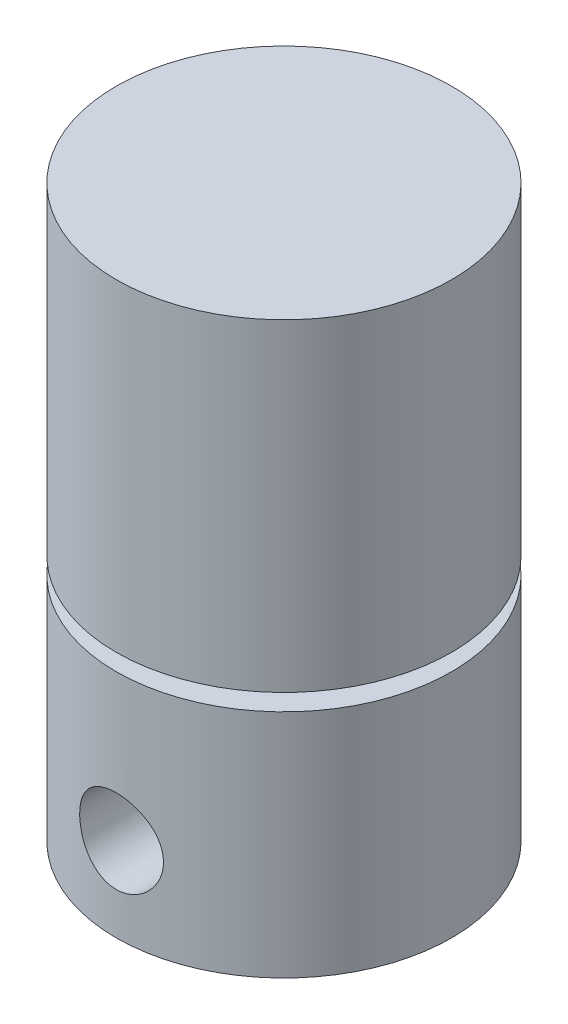
ISO-10303-21;
HEADER;
FILE_DESCRIPTION(('STEP AP214'),'2;1');
FILE_NAME('part.step','',(''),(''),'','','');
FILE_SCHEMA(('AUTOMOTIVE_DESIGN { 1 0 10303 214 1 1 1 1 }'));
ENDSEC;
DATA;
#1=APPLICATION_CONTEXT('core data for automotive mechanical design processes');
#2=APPLICATION_PROTOCOL_DEFINITION('international standard','automotive_design',2000,#1);
#3=PRODUCT_CONTEXT('',#1,'mechanical');
#4=PRODUCT('Part','Part','',(#3));
#5=PRODUCT_RELATED_PRODUCT_CATEGORY('part','',(#4));
#6=PRODUCT_DEFINITION_FORMATION('','',#4);
#7=PRODUCT_DEFINITION_CONTEXT('part definition',#1,'design');
#8=PRODUCT_DEFINITION('design','',#6,#7);
#9=PRODUCT_DEFINITION_SHAPE('','',#8);
#10=(LENGTH_UNIT() NAMED_UNIT(*) SI_UNIT(.MILLI.,.METRE.));
#11=(NAMED_UNIT(*) PLANE_ANGLE_UNIT() SI_UNIT($,.RADIAN.));
#12=(NAMED_UNIT(*) SI_UNIT($,.STERADIAN.) SOLID_ANGLE_UNIT());
#13=UNCERTAINTY_MEASURE_WITH_UNIT(LENGTH_MEASURE(1.E-05),#10,'distance_accuracy_value','');
#14=(GEOMETRIC_REPRESENTATION_CONTEXT(3) GLOBAL_UNCERTAINTY_ASSIGNED_CONTEXT((#13)) GLOBAL_UNIT_ASSIGNED_CONTEXT((#10,
#11,#12)) REPRESENTATION_CONTEXT('',''));
#15=CARTESIAN_POINT('',(0.,0.,0.));
#16=DIRECTION('',(0.,0.,1.));
#17=DIRECTION('',(1.,0.,0.));
#18=AXIS2_PLACEMENT_3D('',#15,#16,#17);
#19=CARTESIAN_POINT('',(0.,17.4625,0.));
#20=DIRECTION('',(0.,-1.,0.));
#21=DIRECTION('',(0.,0.,-1.));
#22=AXIS2_PLACEMENT_3D('',#19,#20,#21);
#23=CYLINDRICAL_SURFACE('',#22,12.7);
#24=CARTESIAN_POINT('',(3.175,6.35,-12.2967221242085));
#25=CARTESIAN_POINT('',(3.1749950198132,6.17467554632325,-12.2967254711158));
#26=CARTESIAN_POINT('',(3.16042833178202,5.99929597867828,-12.3005126863854));
#27=CARTESIAN_POINT('',(3.10263936933902,5.65357317571964,-12.3152136473056));
#28=CARTESIAN_POINT('',(3.05940041756247,5.4832329318254,-12.3261315404947));
#29=CARTESIAN_POINT('',(2.94575382353269,5.15263950650228,-12.3537818023711));
#30=CARTESIAN_POINT('',(2.8753812543752,4.99237361266015,-12.3705066621688));
#31=CARTESIAN_POINT('',(2.70957184940196,4.68590521727435,-12.4078770387652));
#32=CARTESIAN_POINT('',(2.61413394947207,4.53970331315812,-12.4285227220068));
#33=CARTESIAN_POINT('',(2.39865970268609,4.26229571051699,-12.4719170977164));
#34=CARTESIAN_POINT('',(2.27817284738414,4.13144512755544,-12.4946993898125));
#35=CARTESIAN_POINT('',(2.01699122140784,3.89158302916237,-12.5395085190442));
#36=CARTESIAN_POINT('',(1.87629456360899,3.78257355546038,-12.5615352853931));
#37=CARTESIAN_POINT('',(1.57625440537027,3.58803515610828,-12.6027232771114));
#38=CARTESIAN_POINT('',(1.4166781117678,3.50285508703494,-12.6218402299875));
#39=CARTESIAN_POINT('',(1.08491424405181,3.36066175192558,-12.65467131146));
#40=CARTESIAN_POINT('',(0.912728534955764,3.3036443300673,-12.6683862371462));
#41=CARTESIAN_POINT('',(0.564335623617785,3.2205322500852,-12.6886304373719));
#42=CARTESIAN_POINT('',(0.388280553827199,3.19383455170524,-12.6952996518228));
#43=CARTESIAN_POINT('',(0.0340726004637171,3.17022685832005,-12.7011886451627));
#44=CARTESIAN_POINT('',(-0.144079969063347,3.17331245929381,-12.7004095254281));
#45=CARTESIAN_POINT('',(-0.493243384772329,3.20875005981768,-12.6915938059099));
#46=CARTESIAN_POINT('',(-0.664324984533387,3.2404511328184,-12.6837186297291));
#47=CARTESIAN_POINT('',(-0.998658935538454,3.33117351296159,-12.6617836238657));
#48=CARTESIAN_POINT('',(-1.16191086950114,3.39019627442931,-12.6477234649603));
#49=CARTESIAN_POINT('',(-1.47766628361824,3.53441326477257,-12.6147513732012));
#50=CARTESIAN_POINT('',(-1.63005931850865,3.61983914672042,-12.5957967501266));
#51=CARTESIAN_POINT('',(-1.91857510093105,3.81426171247765,-12.5550917783831));
#52=CARTESIAN_POINT('',(-2.05469501139648,3.923262497072,-12.5333409435887));
#53=CARTESIAN_POINT('',(-2.31068256139473,4.16523010231761,-12.4887191648708));
#54=CARTESIAN_POINT('',(-2.43001063106375,4.29876571328164,-12.4658338379713));
#55=CARTESIAN_POINT('',(-2.64469999368259,4.58419196639616,-12.4220610526701));
#56=CARTESIAN_POINT('',(-2.74006016644614,4.7360834659537,-12.4011736876753));
#57=CARTESIAN_POINT('',(-2.90445230964671,5.05496834336905,-12.3637103097324));
#58=CARTESIAN_POINT('',(-2.97335437513118,5.22203137749726,-12.347155693206));
#59=CARTESIAN_POINT('',(-3.08192684552051,5.56588354445759,-12.3205067298881));
#60=CARTESIAN_POINT('',(-3.12160350580598,5.74267058726044,-12.3104110007027));
#61=CARTESIAN_POINT('',(-3.16970364110572,6.095948566943,-12.2981130212947));
#62=CARTESIAN_POINT('',(-3.17892490187728,6.2723239975431,-12.2957093300071));
#63=CARTESIAN_POINT('',(-3.16803657795425,6.62409385946327,-12.2985192607316));
#64=CARTESIAN_POINT('',(-3.14792969326925,6.79948837959579,-12.3037321815428));
#65=CARTESIAN_POINT('',(-3.07965533920158,7.14135511648469,-12.3209949412092));
#66=CARTESIAN_POINT('',(-3.03195236671802,7.30792636274288,-12.3329315220802));
#67=CARTESIAN_POINT('',(-2.91035496372149,7.63070795147373,-12.3621891219376));
#68=CARTESIAN_POINT('',(-2.83645743059488,7.78691706400085,-12.3795107787294));
#69=CARTESIAN_POINT('',(-2.66289874827948,8.08792042289096,-12.418010941113));
#70=CARTESIAN_POINT('',(-2.56276062737126,8.23243062685459,-12.439258441312));
#71=CARTESIAN_POINT('',(-2.34016643006688,8.50288922075787,-12.4830469550031));
#72=CARTESIAN_POINT('',(-2.21770668600727,8.62883455414564,-12.5055881806495));
#73=CARTESIAN_POINT('',(-1.95028413912651,8.86182002406507,-12.5501070185035));
#74=CARTESIAN_POINT('',(-1.80483494928781,8.96830827943698,-12.5720564161859));
#75=CARTESIAN_POINT('',(-1.49765601755559,9.15534855102809,-12.6123346509939));
#76=CARTESIAN_POINT('',(-1.33592712544035,9.23590192009242,-12.6306636769502));
#77=CARTESIAN_POINT('',(-1.00189729049621,9.36808646385047,-12.6615204698767));
#78=CARTESIAN_POINT('',(-0.829682684763527,9.41992564116141,-12.6740898412846));
#79=CARTESIAN_POINT('',(-0.478630489012213,9.49383462495269,-12.6921932261265));
#80=CARTESIAN_POINT('',(-0.299794184005939,9.51591017659858,-12.6977285972965));
#81=CARTESIAN_POINT('',(0.0542401964575508,9.52934209690234,-12.7010848787296));
#82=CARTESIAN_POINT('',(0.229405900617119,9.52151292637792,-12.6991103294396));
#83=CARTESIAN_POINT('',(0.575841801116834,9.47722314834044,-12.6881222125238));
#84=CARTESIAN_POINT('',(0.747112113154448,9.44076339233319,-12.6791088542401));
#85=CARTESIAN_POINT('',(1.08004303817216,9.34068420222751,-12.655087493111));
#86=CARTESIAN_POINT('',(1.24175042029424,9.27721203572685,-12.640112022951));
#87=CARTESIAN_POINT('',(1.55231164340716,9.12504341161286,-12.6057434230086));
#88=CARTESIAN_POINT('',(1.70116386101839,9.03634377427121,-12.5863497364056));
#89=CARTESIAN_POINT('',(1.98565112274399,8.83375413206227,-12.5446551773491));
#90=CARTESIAN_POINT('',(2.12088408784722,8.71931154628034,-12.5222957878978));
#91=CARTESIAN_POINT('',(2.37050268936837,8.46955744497192,-12.4774531075658));
#92=CARTESIAN_POINT('',(2.48488303211817,8.33424064634706,-12.4549697867118));
#93=CARTESIAN_POINT('',(2.69164443404806,8.04354050994846,-12.4119473580947));
#94=CARTESIAN_POINT('',(2.783575266647,7.88782990831532,-12.3914523466269));
#95=CARTESIAN_POINT('',(2.93981789665887,7.56267381964745,-12.3553205869608));
#96=CARTESIAN_POINT('',(3.00414978846308,7.39323843265204,-12.3396803064045));
#97=CARTESIAN_POINT('',(3.09379152821293,7.07841798742337,-12.3174731028359));
#98=CARTESIAN_POINT('',(3.12417831664509,6.93453920307402,-12.3097500503611));
#99=CARTESIAN_POINT('',(3.16478377891537,6.64378634093234,-12.2993733749982));
#100=CARTESIAN_POINT('',(3.17500417313031,6.49691251972402,-12.2967193196792));
#101=CARTESIAN_POINT('',(3.175,6.35,-12.2967221242085));
#102=B_SPLINE_CURVE_WITH_KNOTS('',3,(#24,#25,#26,#27,#28,#29,#30,#31,#32,#33,#34,#35,#36,#37,
#38,#39,#40,#41,#42,#43,#44,#45,#46,#47,#48,#49,#50,#51,#52,#53,#54,#55,#56,#57,#58,#59,#60,#61,
#62,#63,#64,#65,#66,#67,#68,#69,#70,#71,#72,#73,#74,#75,#76,#77,#78,#79,#80,#81,#82,#83,#84,#85,
#86,#87,#88,#89,#90,#91,#92,#93,#94,#95,#96,#97,#98,#99,#100,#101),.UNSPECIFIED.,.T.,.F.,(4,2,2,
2,2,2,2,2,2,2,2,2,2,2,2,2,2,2,2,2,2,2,2,2,2,2,2,2,2,2,2,2,2,2,2,2,2,2,4),(0.,0.525433851004893,
1.05117359161441,1.57623602350085,2.10132074979458,2.6368242182508,3.1723777227943,
3.71540400425358,4.25835013005807,4.7902971376409,5.32216548805846,5.84223193614963,
6.36232607040478,6.88711950303144,7.4120042954552,7.95109492546328,8.49021074623749,
9.03194068650671,9.57355464164525,10.1008633995054,10.6281236152971,11.1467570436797,
11.6654519221148,12.1943221424741,12.7232793399029,13.2654717033223,13.8076357797011,
14.3458193247108,14.8838989712076,15.4074297658815,15.9309449907505,16.4516419323711,
16.9724045329363,17.5056431266551,18.0390169009448,18.5823412615974,19.1252693614627,
19.5655924052587,20.0058778838705),.UNSPECIFIED.);
#103=CARTESIAN_POINT('',(3.175,6.35,-12.2967221242085));
#104=VERTEX_POINT('',#103);
#105=EDGE_CURVE('E68',#104,#104,#102,.T.);
#106=ORIENTED_EDGE('',*,*,#105,.F.);
#107=EDGE_LOOP('',(#106));
#108=FACE_BOUND('',#107,.T.);
#109=CARTESIAN_POINT('',(0.,17.4625,0.));
#110=DIRECTION('',(0.,1.,0.));
#111=DIRECTION('',(0.,0.,1.));
#112=AXIS2_PLACEMENT_3D('',#109,#110,#111);
#113=CIRCLE('',#112,12.7);
#114=CARTESIAN_POINT('',(0.,17.4625,12.7));
#115=VERTEX_POINT('',#114);
#116=EDGE_CURVE('E44',#115,#115,#113,.T.);
#117=ORIENTED_EDGE('',*,*,#116,.F.);
#118=EDGE_LOOP('',(#117));
#119=FACE_BOUND('',#118,.T.);
#120=CARTESIAN_POINT('',(0.,0.,0.));
#121=DIRECTION('',(0.,1.,0.));
#122=DIRECTION('',(0.,0.,1.));
#123=AXIS2_PLACEMENT_3D('',#120,#121,#122);
#124=CIRCLE('',#123,12.7);
#125=CARTESIAN_POINT('',(0.,0.,12.7));
#126=VERTEX_POINT('',#125);
#127=EDGE_CURVE('E40',#126,#126,#124,.T.);
#128=ORIENTED_EDGE('',*,*,#127,.T.);
#129=EDGE_LOOP('',(#128));
#130=FACE_BOUND('',#129,.T.);
#131=CARTESIAN_POINT('',(-3.175,6.35,12.2967221242085));
#132=CARTESIAN_POINT('',(-3.1749950198132,6.52532445367675,12.2967254711158));
#133=CARTESIAN_POINT('',(-3.16042833178202,6.70070402132172,12.3005126863854));
#134=CARTESIAN_POINT('',(-3.10263936933902,7.04642682428036,12.3152136473056));
#135=CARTESIAN_POINT('',(-3.05940041756247,7.21676706817459,12.3261315404947));
#136=CARTESIAN_POINT('',(-2.94575382353269,7.54736049349772,12.3537818023711));
#137=CARTESIAN_POINT('',(-2.8753812543752,7.70762638733985,12.3705066621688));
#138=CARTESIAN_POINT('',(-2.70957184940196,8.01409478272565,12.4078770387652));
#139=CARTESIAN_POINT('',(-2.61413394947207,8.16029668684188,12.4285227220068));
#140=CARTESIAN_POINT('',(-2.39865970268609,8.43770428948301,12.4719170977164));
#141=CARTESIAN_POINT('',(-2.27817284738414,8.56855487244456,12.4946993898125));
#142=CARTESIAN_POINT('',(-2.01699122140784,8.80841697083763,12.5395085190442));
#143=CARTESIAN_POINT('',(-1.87629456360899,8.91742644453962,12.5615352853931));
#144=CARTESIAN_POINT('',(-1.57625440537027,9.11196484389172,12.6027232771114));
#145=CARTESIAN_POINT('',(-1.4166781117678,9.19714491296506,12.6218402299875));
#146=CARTESIAN_POINT('',(-1.08491424405181,9.33933824807441,12.65467131146));
#147=CARTESIAN_POINT('',(-0.912728534955763,9.3963556699327,12.6683862371462));
#148=CARTESIAN_POINT('',(-0.564335623617784,9.4794677499148,12.6886304373719));
#149=CARTESIAN_POINT('',(-0.388280553827198,9.50616544829476,12.6952996518228));
#150=CARTESIAN_POINT('',(-0.0340726004637166,9.52977314167995,12.7011886451627));
#151=CARTESIAN_POINT('',(0.144079969063347,9.52668754070619,12.7004095254281));
#152=CARTESIAN_POINT('',(0.493243384772329,9.49124994018232,12.6915938059099));
#153=CARTESIAN_POINT('',(0.664324984533387,9.4595488671816,12.6837186297291));
#154=CARTESIAN_POINT('',(0.998658935538454,9.3688264870384,12.6617836238657));
#155=CARTESIAN_POINT('',(1.16191086950114,9.30980372557069,12.6477234649603));
#156=CARTESIAN_POINT('',(1.47766628361824,9.16558673522743,12.6147513732012));
#157=CARTESIAN_POINT('',(1.63005931850865,9.08016085327958,12.5957967501266));
#158=CARTESIAN_POINT('',(1.91857510093105,8.88573828752235,12.5550917783831));
#159=CARTESIAN_POINT('',(2.05469501139648,8.776737502928,12.5333409435887));
#160=CARTESIAN_POINT('',(2.31068256139473,8.53476989768239,12.4887191648708));
#161=CARTESIAN_POINT('',(2.43001063106375,8.40123428671837,12.4658338379713));
#162=CARTESIAN_POINT('',(2.64469999368259,8.11580803360384,12.4220610526701));
#163=CARTESIAN_POINT('',(2.74006016644614,7.9639165340463,12.4011736876753));
#164=CARTESIAN_POINT('',(2.90445230964671,7.64503165663095,12.3637103097324));
#165=CARTESIAN_POINT('',(2.97335437513118,7.47796862250274,12.347155693206));
#166=CARTESIAN_POINT('',(3.08192684552051,7.13411645554241,12.3205067298881));
#167=CARTESIAN_POINT('',(3.12160350580598,6.95732941273956,12.3104110007027));
#168=CARTESIAN_POINT('',(3.16970364110572,6.604051433057,12.2981130212947));
#169=CARTESIAN_POINT('',(3.17892490187728,6.4276760024569,12.2957093300071));
#170=CARTESIAN_POINT('',(3.16803657795425,6.07590614053673,12.2985192607316));
#171=CARTESIAN_POINT('',(3.14792969326925,5.90051162040421,12.3037321815428));
#172=CARTESIAN_POINT('',(3.07965533920158,5.55864488351531,12.3209949412092));
#173=CARTESIAN_POINT('',(3.03195236671802,5.39207363725712,12.3329315220802));
#174=CARTESIAN_POINT('',(2.91035496372149,5.06929204852627,12.3621891219376));
#175=CARTESIAN_POINT('',(2.83645743059488,4.91308293599915,12.3795107787294));
#176=CARTESIAN_POINT('',(2.66289874827948,4.61207957710904,12.418010941113));
#177=CARTESIAN_POINT('',(2.56276062737126,4.46756937314542,12.439258441312));
#178=CARTESIAN_POINT('',(2.34016643006688,4.19711077924213,12.4830469550031));
#179=CARTESIAN_POINT('',(2.21770668600727,4.07116544585436,12.5055881806495));
#180=CARTESIAN_POINT('',(1.95028413912651,3.83817997593493,12.5501070185035));
#181=CARTESIAN_POINT('',(1.80483494928781,3.73169172056302,12.5720564161859));
#182=CARTESIAN_POINT('',(1.49765601755559,3.54465144897191,12.6123346509939));
#183=CARTESIAN_POINT('',(1.33592712544035,3.46409807990758,12.6306636769502));
#184=CARTESIAN_POINT('',(1.00189729049621,3.33191353614953,12.6615204698767));
#185=CARTESIAN_POINT('',(0.829682684763526,3.28007435883859,12.6740898412846));
#186=CARTESIAN_POINT('',(0.478630489012213,3.20616537504731,12.6921932261265));
#187=CARTESIAN_POINT('',(0.299794184005939,3.18408982340142,12.6977285972965));
#188=CARTESIAN_POINT('',(-0.0542401964575509,3.17065790309766,12.7010848787296));
#189=CARTESIAN_POINT('',(-0.229405900617119,3.17848707362208,12.6991103294396));
#190=CARTESIAN_POINT('',(-0.575841801116834,3.22277685165956,12.6881222125238));
#191=CARTESIAN_POINT('',(-0.747112113154448,3.25923660766681,12.6791088542401));
#192=CARTESIAN_POINT('',(-1.08004303817216,3.35931579777248,12.655087493111));
#193=CARTESIAN_POINT('',(-1.24175042029424,3.42278796427315,12.640112022951));
#194=CARTESIAN_POINT('',(-1.55231164340716,3.57495658838714,12.6057434230086));
#195=CARTESIAN_POINT('',(-1.70116386101839,3.66365622572879,12.5863497364056));
#196=CARTESIAN_POINT('',(-1.98565112274399,3.86624586793772,12.5446551773491));
#197=CARTESIAN_POINT('',(-2.12088408784722,3.98068845371966,12.5222957878978));
#198=CARTESIAN_POINT('',(-2.37050268936837,4.23044255502808,12.4774531075658));
#199=CARTESIAN_POINT('',(-2.48488303211817,4.36575935365294,12.4549697867118));
#200=CARTESIAN_POINT('',(-2.69164443404806,4.65645949005154,12.4119473580947));
#201=CARTESIAN_POINT('',(-2.783575266647,4.81217009168468,12.3914523466269));
#202=CARTESIAN_POINT('',(-2.93981789665886,5.13732618035255,12.3553205869608));
#203=CARTESIAN_POINT('',(-3.00414978846308,5.30676156734796,12.3396803064045));
#204=CARTESIAN_POINT('',(-3.09379152821293,5.62158201257663,12.3174731028359));
#205=CARTESIAN_POINT('',(-3.12417831664509,5.76546079692598,12.3097500503611));
#206=CARTESIAN_POINT('',(-3.16478377891537,6.05621365906766,12.2993733749982));
#207=CARTESIAN_POINT('',(-3.17500417313031,6.20308748027598,12.2967193196792));
#208=CARTESIAN_POINT('',(-3.175,6.35,12.2967221242085));
#209=B_SPLINE_CURVE_WITH_KNOTS('',3,(#131,#132,#133,#134,#135,#136,#137,#138,#139,#140,#141,
#142,#143,#144,#145,#146,#147,#148,#149,#150,#151,#152,#153,#154,#155,#156,#157,#158,#159,#160,
#161,#162,#163,#164,#165,#166,#167,#168,#169,#170,#171,#172,#173,#174,#175,#176,#177,#178,#179,
#180,#181,#182,#183,#184,#185,#186,#187,#188,#189,#190,#191,#192,#193,#194,#195,#196,#197,#198,
#199,#200,#201,#202,#203,#204,#205,#206,#207,#208),.UNSPECIFIED.,.T.,.F.,(4,2,2,2,2,2,2,2,2,2,2,
2,2,2,2,2,2,2,2,2,2,2,2,2,2,2,2,2,2,2,2,2,2,2,2,2,2,2,4),(0.,0.525433851004893,1.05117359161441,
1.57623602350085,2.10132074979458,2.6368242182508,3.1723777227943,3.71540400425358,
4.25835013005807,4.7902971376409,5.32216548805846,5.84223193614962,6.36232607040478,
6.88711950303144,7.4120042954552,7.95109492546327,8.49021074623748,9.03194068650671,
9.57355464164525,10.1008633995054,10.6281236152971,11.1467570436797,11.6654519221148,
12.1943221424741,12.7232793399029,13.2654717033223,13.8076357797011,14.3458193247108,
14.8838989712076,15.4074297658815,15.9309449907505,16.4516419323711,16.9724045329363,
17.5056431266551,18.0390169009448,18.5823412615974,19.1252693614627,19.5655924052587,
20.0058778838705),.UNSPECIFIED.);
#210=CARTESIAN_POINT('',(-3.175,6.35,12.2967221242085));
#211=VERTEX_POINT('',#210);
#212=EDGE_CURVE('E60',#211,#211,#209,.T.);
#213=ORIENTED_EDGE('',*,*,#212,.T.);
#214=EDGE_LOOP('',(#213));
#215=FACE_BOUND('',#214,.T.);
#216=ADVANCED_FACE('F37',(#108,#119,#130,#215),#23,.T.);
#217=CARTESIAN_POINT('',(0.,17.4625,0.));
#218=DIRECTION('',(0.,1.,0.));
#219=DIRECTION('',(0.,0.,1.));
#220=AXIS2_PLACEMENT_3D('',#217,#218,#219);
#221=PLANE('',#220);
#222=CARTESIAN_POINT('',(0.,17.4625,0.));
#223=DIRECTION('',(0.,1.,0.));
#224=DIRECTION('',(0.,0.,1.));
#225=AXIS2_PLACEMENT_3D('',#222,#223,#224);
#226=CIRCLE('',#225,9.525);
#227=CARTESIAN_POINT('',(0.,17.4625,9.525));
#228=VERTEX_POINT('',#227);
#229=EDGE_CURVE('E10',#228,#228,#226,.T.);
#230=ORIENTED_EDGE('',*,*,#229,.F.);
#231=EDGE_LOOP('',(#230));
#232=FACE_BOUND('',#231,.T.);
#233=ORIENTED_EDGE('',*,*,#116,.T.);
#234=EDGE_LOOP('',(#233));
#235=FACE_BOUND('',#234,.T.);
#236=ADVANCED_FACE('F92',(#232,#235),#221,.T.);
#237=CARTESIAN_POINT('',(0.,0.,0.));
#238=DIRECTION('',(0.,1.,0.));
#239=DIRECTION('',(0.,0.,1.));
#240=AXIS2_PLACEMENT_3D('',#237,#238,#239);
#241=PLANE('',#240);
#242=CARTESIAN_POINT('',(9.525,0.,0.));
#243=DIRECTION('',(0.,-1.,0.));
#244=DIRECTION('',(0.,0.,-1.));
#245=AXIS2_PLACEMENT_3D('',#242,#243,#244);
#246=CIRCLE('',#245,1.5875);
#247=CARTESIAN_POINT('',(9.525,0.,-1.5875));
#248=VERTEX_POINT('',#247);
#249=EDGE_CURVE('E240',#248,#248,#246,.T.);
#250=ORIENTED_EDGE('',*,*,#249,.F.);
#251=EDGE_LOOP('',(#250));
#252=FACE_BOUND('',#251,.T.);
#253=CARTESIAN_POINT('',(-9.525,0.,0.));
#254=DIRECTION('',(0.,-1.,0.));
#255=DIRECTION('',(0.,0.,1.));
#256=AXIS2_PLACEMENT_3D('',#253,#254,#255);
#257=CIRCLE('',#256,1.5875);
#258=CARTESIAN_POINT('',(-9.525,0.,1.5875));
#259=VERTEX_POINT('',#258);
#260=EDGE_CURVE('E234',#259,#259,#257,.T.);
#261=ORIENTED_EDGE('',*,*,#260,.F.);
#262=EDGE_LOOP('',(#261));
#263=FACE_BOUND('',#262,.T.);
#264=ORIENTED_EDGE('',*,*,#127,.F.);
#265=EDGE_LOOP('',(#264));
#266=FACE_BOUND('',#265,.T.);
#267=ADVANCED_FACE('F97',(#252,#263,#266),#241,.F.);
#268=CARTESIAN_POINT('',(0.,18.7325,0.));
#269=DIRECTION('',(0.,-1.,0.));
#270=DIRECTION('',(0.,0.,-1.));
#271=AXIS2_PLACEMENT_3D('',#268,#269,#270);
#272=CYLINDRICAL_SURFACE('',#271,9.525);
#273=CARTESIAN_POINT('',(0.,18.7325,0.));
#274=DIRECTION('',(0.,1.,0.));
#275=DIRECTION('',(0.,0.,1.));
#276=AXIS2_PLACEMENT_3D('',#273,#274,#275);
#277=CIRCLE('',#276,9.525);
#278=CARTESIAN_POINT('',(0.,18.7325,9.525));
#279=VERTEX_POINT('',#278);
#280=EDGE_CURVE('E50',#279,#279,#277,.T.);
#281=ORIENTED_EDGE('',*,*,#280,.F.);
#282=EDGE_LOOP('',(#281));
#283=FACE_BOUND('',#282,.T.);
#284=ORIENTED_EDGE('',*,*,#229,.T.);
#285=EDGE_LOOP('',(#284));
#286=FACE_BOUND('',#285,.T.);
#287=ADVANCED_FACE('F112',(#283,#286),#272,.T.);
#288=CARTESIAN_POINT('',(0.,43.18,0.));
#289=DIRECTION('',(0.,-1.,0.));
#290=DIRECTION('',(0.,0.,-1.));
#291=AXIS2_PLACEMENT_3D('',#288,#289,#290);
#292=CYLINDRICAL_SURFACE('',#291,12.7);
#293=CARTESIAN_POINT('',(0.,43.18,0.));
#294=DIRECTION('',(0.,1.,0.));
#295=DIRECTION('',(0.,0.,1.));
#296=AXIS2_PLACEMENT_3D('',#293,#294,#295);
#297=CIRCLE('',#296,12.7);
#298=CARTESIAN_POINT('',(0.,43.18,12.7));
#299=VERTEX_POINT('',#298);
#300=EDGE_CURVE('E53',#299,#299,#297,.T.);
#301=ORIENTED_EDGE('',*,*,#300,.F.);
#302=EDGE_LOOP('',(#301));
#303=FACE_BOUND('',#302,.T.);
#304=CARTESIAN_POINT('',(0.,18.7325,0.));
#305=DIRECTION('',(0.,1.,0.));
#306=DIRECTION('',(0.,0.,1.));
#307=AXIS2_PLACEMENT_3D('',#304,#305,#306);
#308=CIRCLE('',#307,12.7);
#309=CARTESIAN_POINT('',(0.,18.7325,12.7));
#310=VERTEX_POINT('',#309);
#311=EDGE_CURVE('E54',#310,#310,#308,.T.);
#312=ORIENTED_EDGE('',*,*,#311,.T.);
#313=EDGE_LOOP('',(#312));
#314=FACE_BOUND('',#313,.T.);
#315=ADVANCED_FACE('F117',(#303,#314),#292,.T.);
#316=CARTESIAN_POINT('',(0.,43.18,0.));
#317=DIRECTION('',(0.,1.,0.));
#318=DIRECTION('',(0.,0.,1.));
#319=AXIS2_PLACEMENT_3D('',#316,#317,#318);
#320=PLANE('',#319);
#321=ORIENTED_EDGE('',*,*,#300,.T.);
#322=EDGE_LOOP('',(#321));
#323=FACE_BOUND('',#322,.T.);
#324=ADVANCED_FACE('F125',(#323),#320,.T.);
#325=CARTESIAN_POINT('',(0.,18.7325,0.));
#326=DIRECTION('',(0.,1.,0.));
#327=DIRECTION('',(0.,0.,1.));
#328=AXIS2_PLACEMENT_3D('',#325,#326,#327);
#329=PLANE('',#328);
#330=ORIENTED_EDGE('',*,*,#280,.T.);
#331=EDGE_LOOP('',(#330));
#332=FACE_BOUND('',#331,.T.);
#333=ORIENTED_EDGE('',*,*,#311,.F.);
#334=EDGE_LOOP('',(#333));
#335=FACE_BOUND('',#334,.T.);
#336=ADVANCED_FACE('F88',(#332,#335),#329,.F.);
#337=CARTESIAN_POINT('',(0.,6.35,12.701));
#338=DIRECTION('',(0.,0.,-1.));
#339=DIRECTION('',(-1.,0.,0.));
#340=AXIS2_PLACEMENT_3D('',#337,#338,#339);
#341=CYLINDRICAL_SURFACE('',#340,3.175);
#342=CARTESIAN_POINT('',(0.,6.35,6.35));
#343=DIRECTION('',(0.,0.,1.));
#344=DIRECTION('',(1.,0.,0.));
#345=AXIS2_PLACEMENT_3D('',#342,#343,#344);
#346=CIRCLE('',#345,3.175);
#347=CARTESIAN_POINT('',(3.175,6.35,6.35));
#348=VERTEX_POINT('',#347);
#349=EDGE_CURVE('E57',#348,#348,#346,.T.);
#350=ORIENTED_EDGE('',*,*,#349,.F.);
#351=EDGE_LOOP('',(#350));
#352=FACE_BOUND('',#351,.T.);
#353=ORIENTED_EDGE('',*,*,#212,.F.);
#354=EDGE_LOOP('',(#353));
#355=FACE_BOUND('',#354,.T.);
#356=ADVANCED_FACE('F70',(#352,#355),#341,.F.);
#357=CARTESIAN_POINT('',(0.,6.35,6.35));
#358=DIRECTION('',(0.,0.,1.));
#359=DIRECTION('',(1.,0.,0.));
#360=AXIS2_PLACEMENT_3D('',#357,#358,#359);
#361=PLANE('',#360);
#362=ORIENTED_EDGE('',*,*,#349,.T.);
#363=EDGE_LOOP('',(#362));
#364=FACE_BOUND('',#363,.T.);
#365=ADVANCED_FACE('F79',(#364),#361,.T.);
#366=CARTESIAN_POINT('',(0.,6.35,-12.701));
#367=DIRECTION('',(0.,0.,1.));
#368=DIRECTION('',(1.,0.,0.));
#369=AXIS2_PLACEMENT_3D('',#366,#367,#368);
#370=CYLINDRICAL_SURFACE('',#369,3.175);
#371=CARTESIAN_POINT('',(0.,6.35,-9.398));
#372=DIRECTION('',(0.,0.,1.));
#373=DIRECTION('',(1.,0.,0.));
#374=AXIS2_PLACEMENT_3D('',#371,#372,#373);
#375=CIRCLE('',#374,3.175);
#376=CARTESIAN_POINT('',(3.175,6.35,-9.398));
#377=VERTEX_POINT('',#376);
#378=EDGE_CURVE('E230',#377,#377,#375,.T.);
#379=ORIENTED_EDGE('',*,*,#378,.T.);
#380=EDGE_LOOP('',(#379));
#381=FACE_BOUND('',#380,.T.);
#382=ORIENTED_EDGE('',*,*,#105,.T.);
#383=EDGE_LOOP('',(#382));
#384=FACE_BOUND('',#383,.T.);
#385=ADVANCED_FACE('F76',(#381,#384),#370,.F.);
#386=CARTESIAN_POINT('',(0.,6.35,-9.398));
#387=DIRECTION('',(0.,0.,1.));
#388=DIRECTION('',(1.,0.,0.));
#389=AXIS2_PLACEMENT_3D('',#386,#387,#388);
#390=PLANE('',#389);
#391=ORIENTED_EDGE('',*,*,#378,.F.);
#392=EDGE_LOOP('',(#391));
#393=FACE_BOUND('',#392,.T.);
#394=ADVANCED_FACE('F86',(#393),#390,.F.);
#395=CARTESIAN_POINT('',(-9.525,6.35,0.));
#396=DIRECTION('',(0.,-1.,0.));
#397=DIRECTION('',(0.,0.,-1.));
#398=AXIS2_PLACEMENT_3D('',#395,#396,#397);
#399=CYLINDRICAL_SURFACE('',#398,1.5875);
#400=CARTESIAN_POINT('',(-9.525,6.35,0.));
#401=DIRECTION('',(0.,-1.,0.));
#402=DIRECTION('',(0.,0.,1.));
#403=AXIS2_PLACEMENT_3D('',#400,#401,#402);
#404=CIRCLE('',#403,1.5875);
#405=CARTESIAN_POINT('',(-9.525,6.35,1.5875));
#406=VERTEX_POINT('',#405);
#407=EDGE_CURVE('E237',#406,#406,#404,.T.);
#408=ORIENTED_EDGE('',*,*,#407,.F.);
#409=EDGE_LOOP('',(#408));
#410=FACE_BOUND('',#409,.T.);
#411=ORIENTED_EDGE('',*,*,#260,.T.);
#412=EDGE_LOOP('',(#411));
#413=FACE_BOUND('',#412,.T.);
#414=ADVANCED_FACE('F173',(#410,#413),#399,.F.);
#415=CARTESIAN_POINT('',(-9.525,6.35,0.));
#416=DIRECTION('',(0.,1.,0.));
#417=DIRECTION('',(0.,0.,1.));
#418=AXIS2_PLACEMENT_3D('',#415,#416,#417);
#419=PLANE('',#418);
#420=ORIENTED_EDGE('',*,*,#407,.T.);
#421=EDGE_LOOP('',(#420));
#422=FACE_BOUND('',#421,.T.);
#423=ADVANCED_FACE('F189',(#422),#419,.F.);
#424=CARTESIAN_POINT('',(9.525,6.35,0.));
#425=DIRECTION('',(0.,-1.,0.));
#426=DIRECTION('',(0.,0.,-1.));
#427=AXIS2_PLACEMENT_3D('',#424,#425,#426);
#428=CYLINDRICAL_SURFACE('',#427,1.5875);
#429=CARTESIAN_POINT('',(9.525,6.35,0.));
#430=DIRECTION('',(0.,-1.,0.));
#431=DIRECTION('',(0.,0.,-1.));
#432=AXIS2_PLACEMENT_3D('',#429,#430,#431);
#433=CIRCLE('',#432,1.5875);
#434=CARTESIAN_POINT('',(9.525,6.35,-1.5875));
#435=VERTEX_POINT('',#434);
#436=EDGE_CURVE('E233',#435,#435,#433,.T.);
#437=ORIENTED_EDGE('',*,*,#436,.F.);
#438=EDGE_LOOP('',(#437));
#439=FACE_BOUND('',#438,.T.);
#440=ORIENTED_EDGE('',*,*,#249,.T.);
#441=EDGE_LOOP('',(#440));
#442=FACE_BOUND('',#441,.T.);
#443=ADVANCED_FACE('F199',(#439,#442),#428,.F.);
#444=CARTESIAN_POINT('',(9.525,6.35,0.));
#445=DIRECTION('',(0.,-1.,0.));
#446=DIRECTION('',(0.,0.,-1.));
#447=AXIS2_PLACEMENT_3D('',#444,#445,#446);
#448=PLANE('',#447);
#449=ORIENTED_EDGE('',*,*,#436,.T.);
#450=EDGE_LOOP('',(#449));
#451=FACE_BOUND('',#450,.T.);
#452=ADVANCED_FACE('F209',(#451),#448,.T.);
#453=CLOSED_SHELL('',(#216,#236,#267,#287,#315,#324,#336,#356,#365,#385,#394,#414,#423,#443,#452));
#454=MANIFOLD_SOLID_BREP('B2',#453);
#455=ADVANCED_BREP_SHAPE_REPRESENTATION('',(#18,#454),#14);
#456=SHAPE_DEFINITION_REPRESENTATION(#9,#455);
ENDSEC;
END-ISO-10303-21;
